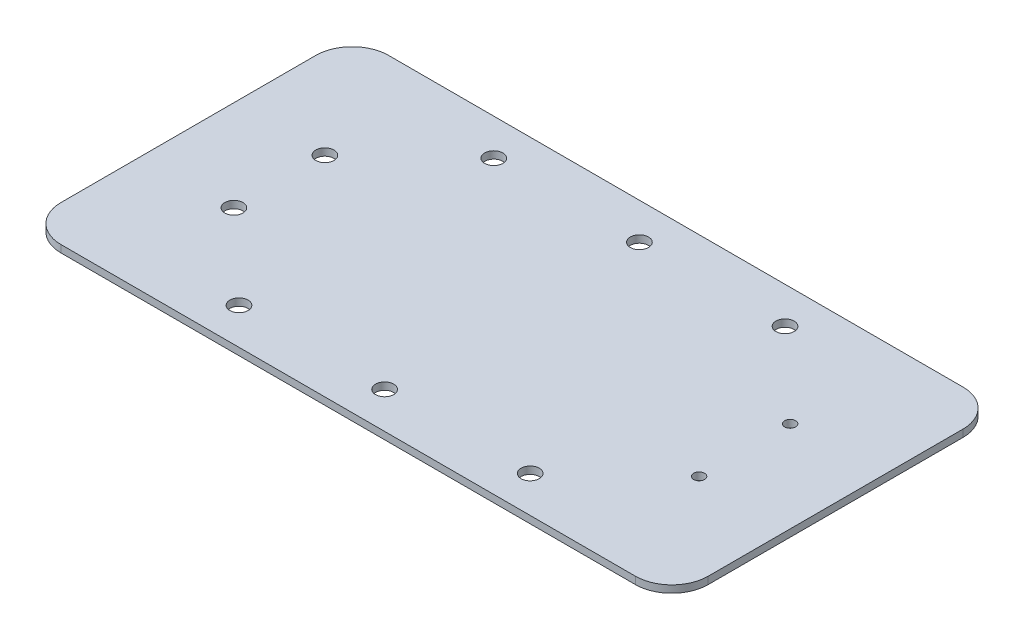
ISO-10303-21;
HEADER;
FILE_DESCRIPTION(('STEP AP214'),'2;1');
FILE_NAME('part.step','',(''),(''),'','','');
FILE_SCHEMA(('AUTOMOTIVE_DESIGN { 1 0 10303 214 1 1 1 1 }'));
ENDSEC;
DATA;
#1=APPLICATION_CONTEXT('core data for automotive mechanical design processes');
#2=APPLICATION_PROTOCOL_DEFINITION('international standard','automotive_design',2000,#1);
#3=PRODUCT_CONTEXT('',#1,'mechanical');
#4=PRODUCT('Part','Part','',(#3));
#5=PRODUCT_RELATED_PRODUCT_CATEGORY('part','',(#4));
#6=PRODUCT_DEFINITION_FORMATION('','',#4);
#7=PRODUCT_DEFINITION_CONTEXT('part definition',#1,'design');
#8=PRODUCT_DEFINITION('design','',#6,#7);
#9=PRODUCT_DEFINITION_SHAPE('','',#8);
#10=(LENGTH_UNIT() NAMED_UNIT(*) SI_UNIT(.MILLI.,.METRE.));
#11=(NAMED_UNIT(*) PLANE_ANGLE_UNIT() SI_UNIT($,.RADIAN.));
#12=(NAMED_UNIT(*) SI_UNIT($,.STERADIAN.) SOLID_ANGLE_UNIT());
#13=UNCERTAINTY_MEASURE_WITH_UNIT(LENGTH_MEASURE(1.E-05),#10,'distance_accuracy_value','');
#14=(GEOMETRIC_REPRESENTATION_CONTEXT(3) GLOBAL_UNCERTAINTY_ASSIGNED_CONTEXT((#13)) GLOBAL_UNIT_ASSIGNED_CONTEXT((#10,
#11,#12)) REPRESENTATION_CONTEXT('',''));
#15=CARTESIAN_POINT('',(0.,0.,0.));
#16=DIRECTION('',(0.,0.,1.));
#17=DIRECTION('',(1.,0.,0.));
#18=AXIS2_PLACEMENT_3D('',#15,#16,#17);
#19=CARTESIAN_POINT('',(0.,2.,0.));
#20=DIRECTION('',(0.,1.,0.));
#21=DIRECTION('',(0.,0.,1.));
#22=AXIS2_PLACEMENT_3D('',#19,#20,#21);
#23=PLANE('',#22);
#24=CARTESIAN_POINT('',(63.9,2.,12.5));
#25=DIRECTION('',(0.,1.,0.));
#26=DIRECTION('',(0.,0.,1.));
#27=AXIS2_PLACEMENT_3D('',#24,#25,#26);
#28=CIRCLE('',#27,1.5);
#29=CARTESIAN_POINT('',(63.9,2.,14.));
#30=VERTEX_POINT('',#29);
#31=EDGE_CURVE('E434',#30,#30,#28,.T.);
#32=ORIENTED_EDGE('',*,*,#31,.F.);
#33=EDGE_LOOP('',(#32));
#34=FACE_BOUND('',#33,.T.);
#35=CARTESIAN_POINT('',(63.9,2.,-12.5));
#36=DIRECTION('',(0.,1.,0.));
#37=DIRECTION('',(0.,0.,1.));
#38=AXIS2_PLACEMENT_3D('',#35,#36,#37);
#39=CIRCLE('',#38,1.5);
#40=CARTESIAN_POINT('',(63.9,2.,-11.));
#41=VERTEX_POINT('',#40);
#42=EDGE_CURVE('E442',#41,#41,#39,.F.);
#43=ORIENTED_EDGE('',*,*,#42,.T.);
#44=EDGE_LOOP('',(#43));
#45=FACE_BOUND('',#44,.T.);
#46=CARTESIAN_POINT('',(-63.9,2.,12.5));
#47=DIRECTION('',(0.,1.,0.));
#48=DIRECTION('',(0.,0.,1.));
#49=AXIS2_PLACEMENT_3D('',#46,#47,#48);
#50=CIRCLE('',#49,2.5);
#51=CARTESIAN_POINT('',(-63.9,2.,15.));
#52=VERTEX_POINT('',#51);
#53=EDGE_CURVE('E242',#52,#52,#50,.F.);
#54=ORIENTED_EDGE('',*,*,#53,.T.);
#55=EDGE_LOOP('',(#54));
#56=FACE_BOUND('',#55,.T.);
#57=CARTESIAN_POINT('',(0.,2.,-35.));
#58=DIRECTION('',(0.,1.,0.));
#59=DIRECTION('',(0.,0.,1.));
#60=AXIS2_PLACEMENT_3D('',#57,#58,#59);
#61=CIRCLE('',#60,2.5);
#62=CARTESIAN_POINT('',(0.,2.,-32.5));
#63=VERTEX_POINT('',#62);
#64=EDGE_CURVE('E170',#63,#63,#61,.T.);
#65=ORIENTED_EDGE('',*,*,#64,.F.);
#66=EDGE_LOOP('',(#65));
#67=FACE_BOUND('',#66,.T.);
#68=CARTESIAN_POINT('',(40.,2.,-35.));
#69=DIRECTION('',(0.,1.,0.));
#70=DIRECTION('',(0.,0.,1.));
#71=AXIS2_PLACEMENT_3D('',#68,#69,#70);
#72=CIRCLE('',#71,2.5);
#73=CARTESIAN_POINT('',(40.,2.,-32.5));
#74=VERTEX_POINT('',#73);
#75=EDGE_CURVE('E232',#74,#74,#72,.T.);
#76=ORIENTED_EDGE('',*,*,#75,.F.);
#77=EDGE_LOOP('',(#76));
#78=FACE_BOUND('',#77,.T.);
#79=CARTESIAN_POINT('',(-40.,2.,-34.9999999999997));
#80=DIRECTION('',(0.,1.,0.));
#81=DIRECTION('',(0.,0.,1.));
#82=AXIS2_PLACEMENT_3D('',#79,#80,#81);
#83=CIRCLE('',#82,2.5);
#84=CARTESIAN_POINT('',(-40.,2.,-32.4999999999997));
#85=VERTEX_POINT('',#84);
#86=EDGE_CURVE('E228',#85,#85,#83,.T.);
#87=ORIENTED_EDGE('',*,*,#86,.F.);
#88=EDGE_LOOP('',(#87));
#89=FACE_BOUND('',#88,.T.);
#90=DIRECTION('',(1.,0.,0.));
#91=VECTOR('',#90,1.);
#92=CARTESIAN_POINT('',(0.,2.,45.));
#93=LINE('',#92,#91);
#94=CARTESIAN_POINT('',(-78.9,2.,45.));
#95=VERTEX_POINT('',#94);
#96=CARTESIAN_POINT('',(78.9,2.,45.));
#97=VERTEX_POINT('',#96);
#98=EDGE_CURVE('E224',#95,#97,#93,.T.);
#99=ORIENTED_EDGE('',*,*,#98,.T.);
#100=CARTESIAN_POINT('',(78.9,2.,35.));
#101=DIRECTION('',(0.,1.,0.));
#102=DIRECTION('',(0.,0.,1.));
#103=AXIS2_PLACEMENT_3D('',#100,#101,#102);
#104=CIRCLE('',#103,10.);
#105=CARTESIAN_POINT('',(88.9,2.,35.));
#106=VERTEX_POINT('',#105);
#107=EDGE_CURVE('E194',#97,#106,#104,.T.);
#108=ORIENTED_EDGE('',*,*,#107,.T.);
#109=DIRECTION('',(0.,0.,-1.));
#110=VECTOR('',#109,1.);
#111=CARTESIAN_POINT('',(88.9,2.,0.));
#112=LINE('',#111,#110);
#113=CARTESIAN_POINT('',(88.9,2.,-35.));
#114=VERTEX_POINT('',#113);
#115=EDGE_CURVE('E135',#106,#114,#112,.T.);
#116=ORIENTED_EDGE('',*,*,#115,.T.);
#117=CARTESIAN_POINT('',(78.9,2.,-35.));
#118=DIRECTION('',(0.,1.,0.));
#119=DIRECTION('',(0.,0.,1.));
#120=AXIS2_PLACEMENT_3D('',#117,#118,#119);
#121=CIRCLE('',#120,10.);
#122=CARTESIAN_POINT('',(78.9,2.,-45.));
#123=VERTEX_POINT('',#122);
#124=EDGE_CURVE('E191',#114,#123,#121,.T.);
#125=ORIENTED_EDGE('',*,*,#124,.T.);
#126=DIRECTION('',(1.,0.,0.));
#127=VECTOR('',#126,1.);
#128=CARTESIAN_POINT('',(0.,2.,-45.));
#129=LINE('',#128,#127);
#130=CARTESIAN_POINT('',(-78.9,2.,-45.));
#131=VERTEX_POINT('',#130);
#132=EDGE_CURVE('E218',#131,#123,#129,.T.);
#133=ORIENTED_EDGE('',*,*,#132,.F.);
#134=CARTESIAN_POINT('',(-78.9,2.,-35.));
#135=DIRECTION('',(0.,1.,0.));
#136=DIRECTION('',(0.,0.,1.));
#137=AXIS2_PLACEMENT_3D('',#134,#135,#136);
#138=CIRCLE('',#137,10.);
#139=CARTESIAN_POINT('',(-88.9,2.,-35.));
#140=VERTEX_POINT('',#139);
#141=EDGE_CURVE('E63',#131,#140,#138,.T.);
#142=ORIENTED_EDGE('',*,*,#141,.T.);
#143=DIRECTION('',(0.,0.,-1.));
#144=VECTOR('',#143,1.);
#145=CARTESIAN_POINT('',(-88.9,2.,0.));
#146=LINE('',#145,#144);
#147=CARTESIAN_POINT('',(-88.9,2.,35.));
#148=VERTEX_POINT('',#147);
#149=EDGE_CURVE('E215',#148,#140,#146,.T.);
#150=ORIENTED_EDGE('',*,*,#149,.F.);
#151=CARTESIAN_POINT('',(-78.9,2.,35.));
#152=DIRECTION('',(0.,1.,0.));
#153=DIRECTION('',(0.,0.,1.));
#154=AXIS2_PLACEMENT_3D('',#151,#152,#153);
#155=CIRCLE('',#154,10.);
#156=EDGE_CURVE('E186',#148,#95,#155,.T.);
#157=ORIENTED_EDGE('',*,*,#156,.T.);
#158=EDGE_LOOP('',(#99,#108,#116,#125,#133,#142,#150,#157));
#159=FACE_BOUND('',#158,.T.);
#160=CARTESIAN_POINT('',(0.,2.,35.));
#161=DIRECTION('',(0.,1.,0.));
#162=DIRECTION('',(0.,0.,1.));
#163=AXIS2_PLACEMENT_3D('',#160,#161,#162);
#164=CIRCLE('',#163,2.5);
#165=CARTESIAN_POINT('',(0.,2.,37.5));
#166=VERTEX_POINT('',#165);
#167=EDGE_CURVE('E211',#166,#166,#164,.F.);
#168=ORIENTED_EDGE('',*,*,#167,.T.);
#169=EDGE_LOOP('',(#168));
#170=FACE_BOUND('',#169,.T.);
#171=CARTESIAN_POINT('',(40.,2.,35.));
#172=DIRECTION('',(0.,1.,0.));
#173=DIRECTION('',(0.,0.,1.));
#174=AXIS2_PLACEMENT_3D('',#171,#172,#173);
#175=CIRCLE('',#174,2.5);
#176=CARTESIAN_POINT('',(40.,2.,37.5));
#177=VERTEX_POINT('',#176);
#178=EDGE_CURVE('E207',#177,#177,#175,.F.);
#179=ORIENTED_EDGE('',*,*,#178,.T.);
#180=EDGE_LOOP('',(#179));
#181=FACE_BOUND('',#180,.T.);
#182=CARTESIAN_POINT('',(-40.,2.,35.0000000000003));
#183=DIRECTION('',(0.,1.,0.));
#184=DIRECTION('',(0.,0.,1.));
#185=AXIS2_PLACEMENT_3D('',#182,#183,#184);
#186=CIRCLE('',#185,2.5);
#187=CARTESIAN_POINT('',(-40.,2.,37.5000000000003));
#188=VERTEX_POINT('',#187);
#189=EDGE_CURVE('E172',#188,#188,#186,.F.);
#190=ORIENTED_EDGE('',*,*,#189,.T.);
#191=EDGE_LOOP('',(#190));
#192=FACE_BOUND('',#191,.T.);
#193=CARTESIAN_POINT('',(-63.9,2.,-12.5));
#194=DIRECTION('',(0.,1.,0.));
#195=DIRECTION('',(0.,0.,1.));
#196=AXIS2_PLACEMENT_3D('',#193,#194,#195);
#197=CIRCLE('',#196,2.5);
#198=CARTESIAN_POINT('',(-63.9,2.,-10.));
#199=VERTEX_POINT('',#198);
#200=EDGE_CURVE('E426',#199,#199,#197,.T.);
#201=ORIENTED_EDGE('',*,*,#200,.F.);
#202=EDGE_LOOP('',(#201));
#203=FACE_BOUND('',#202,.T.);
#204=ADVANCED_FACE('F47',(#34,#45,#56,#67,#78,#89,#159,#170,#181,#192,#203),#23,.T.);
#205=CARTESIAN_POINT('',(0.,0.,0.));
#206=DIRECTION('',(0.,1.,0.));
#207=DIRECTION('',(0.,0.,1.));
#208=AXIS2_PLACEMENT_3D('',#205,#206,#207);
#209=PLANE('',#208);
#210=CARTESIAN_POINT('',(63.9,0.,-12.5));
#211=DIRECTION('',(0.,-1.,0.));
#212=DIRECTION('',(0.,0.,-1.));
#213=AXIS2_PLACEMENT_3D('',#210,#211,#212);
#214=CIRCLE('',#213,1.5);
#215=CARTESIAN_POINT('',(63.9,0.,-14.));
#216=VERTEX_POINT('',#215);
#217=EDGE_CURVE('E449',#216,#216,#214,.T.);
#218=ORIENTED_EDGE('',*,*,#217,.F.);
#219=EDGE_LOOP('',(#218));
#220=FACE_BOUND('',#219,.T.);
#221=CARTESIAN_POINT('',(-63.9,0.,12.5));
#222=DIRECTION('',(0.,-1.,0.));
#223=DIRECTION('',(0.,0.,-1.));
#224=AXIS2_PLACEMENT_3D('',#221,#222,#223);
#225=CIRCLE('',#224,2.5);
#226=CARTESIAN_POINT('',(-63.9,0.,10.));
#227=VERTEX_POINT('',#226);
#228=EDGE_CURVE('E429',#227,#227,#225,.T.);
#229=ORIENTED_EDGE('',*,*,#228,.F.);
#230=EDGE_LOOP('',(#229));
#231=FACE_BOUND('',#230,.T.);
#232=CARTESIAN_POINT('',(0.,0.,-35.));
#233=DIRECTION('',(0.,1.,0.));
#234=DIRECTION('',(0.,0.,1.));
#235=AXIS2_PLACEMENT_3D('',#232,#233,#234);
#236=CIRCLE('',#235,2.5);
#237=CARTESIAN_POINT('',(0.,0.,-32.5));
#238=VERTEX_POINT('',#237);
#239=EDGE_CURVE('E245',#238,#238,#236,.T.);
#240=ORIENTED_EDGE('',*,*,#239,.T.);
#241=EDGE_LOOP('',(#240));
#242=FACE_BOUND('',#241,.T.);
#243=CARTESIAN_POINT('',(40.,0.,-35.));
#244=DIRECTION('',(0.,1.,0.));
#245=DIRECTION('',(0.,0.,1.));
#246=AXIS2_PLACEMENT_3D('',#243,#244,#245);
#247=CIRCLE('',#246,2.5);
#248=CARTESIAN_POINT('',(40.,0.,-32.5));
#249=VERTEX_POINT('',#248);
#250=EDGE_CURVE('E249',#249,#249,#247,.T.);
#251=ORIENTED_EDGE('',*,*,#250,.T.);
#252=EDGE_LOOP('',(#251));
#253=FACE_BOUND('',#252,.T.);
#254=CARTESIAN_POINT('',(-40.,0.,-34.9999999999997));
#255=DIRECTION('',(0.,1.,0.));
#256=DIRECTION('',(0.,0.,1.));
#257=AXIS2_PLACEMENT_3D('',#254,#255,#256);
#258=CIRCLE('',#257,2.5);
#259=CARTESIAN_POINT('',(-40.,0.,-32.4999999999997));
#260=VERTEX_POINT('',#259);
#261=EDGE_CURVE('E151',#260,#260,#258,.T.);
#262=ORIENTED_EDGE('',*,*,#261,.T.);
#263=EDGE_LOOP('',(#262));
#264=FACE_BOUND('',#263,.T.);
#265=DIRECTION('',(0.,0.,-1.));
#266=VECTOR('',#265,1.);
#267=CARTESIAN_POINT('',(88.9,0.,0.));
#268=LINE('',#267,#266);
#269=CARTESIAN_POINT('',(88.9,0.,35.));
#270=VERTEX_POINT('',#269);
#271=CARTESIAN_POINT('',(88.9,0.,-35.));
#272=VERTEX_POINT('',#271);
#273=EDGE_CURVE('E132',#270,#272,#268,.T.);
#274=ORIENTED_EDGE('',*,*,#273,.F.);
#275=CARTESIAN_POINT('',(78.9,0.,35.));
#276=DIRECTION('',(0.,1.,0.));
#277=DIRECTION('',(0.,0.,1.));
#278=AXIS2_PLACEMENT_3D('',#275,#276,#277);
#279=CIRCLE('',#278,10.);
#280=CARTESIAN_POINT('',(78.9,0.,45.));
#281=VERTEX_POINT('',#280);
#282=EDGE_CURVE('E114',#270,#281,#279,.F.);
#283=ORIENTED_EDGE('',*,*,#282,.T.);
#284=DIRECTION('',(1.,0.,0.));
#285=VECTOR('',#284,1.);
#286=CARTESIAN_POINT('',(0.,0.,45.));
#287=LINE('',#286,#285);
#288=CARTESIAN_POINT('',(-78.9,0.,45.));
#289=VERTEX_POINT('',#288);
#290=EDGE_CURVE('E145',#289,#281,#287,.T.);
#291=ORIENTED_EDGE('',*,*,#290,.F.);
#292=CARTESIAN_POINT('',(-78.9,0.,35.));
#293=DIRECTION('',(0.,1.,0.));
#294=DIRECTION('',(0.,0.,1.));
#295=AXIS2_PLACEMENT_3D('',#292,#293,#294);
#296=CIRCLE('',#295,10.);
#297=CARTESIAN_POINT('',(-88.9,0.,35.));
#298=VERTEX_POINT('',#297);
#299=EDGE_CURVE('E137',#289,#298,#296,.F.);
#300=ORIENTED_EDGE('',*,*,#299,.T.);
#301=DIRECTION('',(0.,0.,-1.));
#302=VECTOR('',#301,1.);
#303=CARTESIAN_POINT('',(-88.9,0.,0.));
#304=LINE('',#303,#302);
#305=CARTESIAN_POINT('',(-88.9,0.,-35.));
#306=VERTEX_POINT('',#305);
#307=EDGE_CURVE('E149',#298,#306,#304,.T.);
#308=ORIENTED_EDGE('',*,*,#307,.T.);
#309=CARTESIAN_POINT('',(-78.9,0.,-35.));
#310=DIRECTION('',(0.,1.,0.));
#311=DIRECTION('',(0.,0.,1.));
#312=AXIS2_PLACEMENT_3D('',#309,#310,#311);
#313=CIRCLE('',#312,10.);
#314=CARTESIAN_POINT('',(-78.9,0.,-45.));
#315=VERTEX_POINT('',#314);
#316=EDGE_CURVE('E176',#306,#315,#313,.F.);
#317=ORIENTED_EDGE('',*,*,#316,.T.);
#318=DIRECTION('',(1.,0.,0.));
#319=VECTOR('',#318,1.);
#320=CARTESIAN_POINT('',(0.,0.,-45.));
#321=LINE('',#320,#319);
#322=CARTESIAN_POINT('',(78.9,0.,-45.));
#323=VERTEX_POINT('',#322);
#324=EDGE_CURVE('E144',#315,#323,#321,.T.);
#325=ORIENTED_EDGE('',*,*,#324,.T.);
#326=CARTESIAN_POINT('',(78.9,0.,-35.));
#327=DIRECTION('',(0.,1.,0.));
#328=DIRECTION('',(0.,0.,1.));
#329=AXIS2_PLACEMENT_3D('',#326,#327,#328);
#330=CIRCLE('',#329,10.);
#331=EDGE_CURVE('E126',#323,#272,#330,.F.);
#332=ORIENTED_EDGE('',*,*,#331,.T.);
#333=EDGE_LOOP('',(#274,#283,#291,#300,#308,#317,#325,#332));
#334=FACE_BOUND('',#333,.T.);
#335=CARTESIAN_POINT('',(0.,0.,35.));
#336=DIRECTION('',(0.,1.,0.));
#337=DIRECTION('',(0.,0.,1.));
#338=AXIS2_PLACEMENT_3D('',#335,#336,#337);
#339=CIRCLE('',#338,2.5);
#340=CARTESIAN_POINT('',(0.,0.,37.5));
#341=VERTEX_POINT('',#340);
#342=EDGE_CURVE('E158',#341,#341,#339,.F.);
#343=ORIENTED_EDGE('',*,*,#342,.F.);
#344=EDGE_LOOP('',(#343));
#345=FACE_BOUND('',#344,.T.);
#346=CARTESIAN_POINT('',(40.,0.,35.));
#347=DIRECTION('',(0.,1.,0.));
#348=DIRECTION('',(0.,0.,1.));
#349=AXIS2_PLACEMENT_3D('',#346,#347,#348);
#350=CIRCLE('',#349,2.5);
#351=CARTESIAN_POINT('',(40.,0.,37.5));
#352=VERTEX_POINT('',#351);
#353=EDGE_CURVE('E162',#352,#352,#350,.F.);
#354=ORIENTED_EDGE('',*,*,#353,.F.);
#355=EDGE_LOOP('',(#354));
#356=FACE_BOUND('',#355,.T.);
#357=CARTESIAN_POINT('',(-40.,0.,35.0000000000003));
#358=DIRECTION('',(0.,1.,0.));
#359=DIRECTION('',(0.,0.,1.));
#360=AXIS2_PLACEMENT_3D('',#357,#358,#359);
#361=CIRCLE('',#360,2.5);
#362=CARTESIAN_POINT('',(-40.,0.,37.5000000000003));
#363=VERTEX_POINT('',#362);
#364=EDGE_CURVE('E166',#363,#363,#361,.F.);
#365=ORIENTED_EDGE('',*,*,#364,.F.);
#366=EDGE_LOOP('',(#365));
#367=FACE_BOUND('',#366,.T.);
#368=CARTESIAN_POINT('',(63.9,0.,12.5));
#369=DIRECTION('',(0.,-1.,0.));
#370=DIRECTION('',(0.,0.,-1.));
#371=AXIS2_PLACEMENT_3D('',#368,#369,#370);
#372=CIRCLE('',#371,1.5);
#373=CARTESIAN_POINT('',(63.9,0.,11.));
#374=VERTEX_POINT('',#373);
#375=EDGE_CURVE('E438',#374,#374,#372,.F.);
#376=ORIENTED_EDGE('',*,*,#375,.T.);
#377=EDGE_LOOP('',(#376));
#378=FACE_BOUND('',#377,.T.);
#379=CARTESIAN_POINT('',(-63.9,0.,-12.5));
#380=DIRECTION('',(0.,-1.,0.));
#381=DIRECTION('',(0.,0.,-1.));
#382=AXIS2_PLACEMENT_3D('',#379,#380,#381);
#383=CIRCLE('',#382,2.5);
#384=CARTESIAN_POINT('',(-63.9,0.,-15.));
#385=VERTEX_POINT('',#384);
#386=EDGE_CURVE('E423',#385,#385,#383,.F.);
#387=ORIENTED_EDGE('',*,*,#386,.T.);
#388=EDGE_LOOP('',(#387));
#389=FACE_BOUND('',#388,.T.);
#390=ADVANCED_FACE('F140',(#220,#231,#242,#253,#264,#334,#345,#356,#367,#378,#389),#209,.F.);
#391=CARTESIAN_POINT('',(0.,2.,45.));
#392=DIRECTION('',(0.,0.,-1.));
#393=DIRECTION('',(-1.,0.,0.));
#394=AXIS2_PLACEMENT_3D('',#391,#392,#393);
#395=PLANE('',#394);
#396=ORIENTED_EDGE('',*,*,#290,.T.);
#397=DIRECTION('',(0.,-1.,0.));
#398=VECTOR('',#397,1.);
#399=CARTESIAN_POINT('',(78.9,2.,45.));
#400=LINE('',#399,#398);
#401=EDGE_CURVE('E119',#281,#97,#400,.F.);
#402=ORIENTED_EDGE('',*,*,#401,.T.);
#403=ORIENTED_EDGE('',*,*,#98,.F.);
#404=DIRECTION('',(0.,-1.,0.));
#405=VECTOR('',#404,1.);
#406=CARTESIAN_POINT('',(-78.9,0.,45.));
#407=LINE('',#406,#405);
#408=EDGE_CURVE('E125',#95,#289,#407,.T.);
#409=ORIENTED_EDGE('',*,*,#408,.T.);
#410=EDGE_LOOP('',(#396,#402,#403,#409));
#411=FACE_BOUND('',#410,.T.);
#412=ADVANCED_FACE('F281',(#411),#395,.F.);
#413=CARTESIAN_POINT('',(88.9,2.,0.));
#414=DIRECTION('',(-1.,0.,0.));
#415=DIRECTION('',(0.,0.,1.));
#416=AXIS2_PLACEMENT_3D('',#413,#414,#415);
#417=PLANE('',#416);
#418=ORIENTED_EDGE('',*,*,#115,.F.);
#419=DIRECTION('',(0.,-1.,0.));
#420=VECTOR('',#419,1.);
#421=CARTESIAN_POINT('',(88.9,2.,35.));
#422=LINE('',#421,#420);
#423=EDGE_CURVE('E118',#106,#270,#422,.T.);
#424=ORIENTED_EDGE('',*,*,#423,.T.);
#425=ORIENTED_EDGE('',*,*,#273,.T.);
#426=DIRECTION('',(0.,-1.,0.));
#427=VECTOR('',#426,1.);
#428=CARTESIAN_POINT('',(88.9,2.,-35.));
#429=LINE('',#428,#427);
#430=EDGE_CURVE('E138',#272,#114,#429,.F.);
#431=ORIENTED_EDGE('',*,*,#430,.T.);
#432=EDGE_LOOP('',(#418,#424,#425,#431));
#433=FACE_BOUND('',#432,.T.);
#434=ADVANCED_FACE('F131',(#433),#417,.F.);
#435=CARTESIAN_POINT('',(0.,2.,-45.));
#436=DIRECTION('',(0.,0.,-1.));
#437=DIRECTION('',(-1.,0.,0.));
#438=AXIS2_PLACEMENT_3D('',#435,#436,#437);
#439=PLANE('',#438);
#440=ORIENTED_EDGE('',*,*,#132,.T.);
#441=DIRECTION('',(0.,-1.,0.));
#442=VECTOR('',#441,1.);
#443=CARTESIAN_POINT('',(78.9,0.,-45.));
#444=LINE('',#443,#442);
#445=EDGE_CURVE('E200',#123,#323,#444,.T.);
#446=ORIENTED_EDGE('',*,*,#445,.T.);
#447=ORIENTED_EDGE('',*,*,#324,.F.);
#448=DIRECTION('',(0.,-1.,0.));
#449=VECTOR('',#448,1.);
#450=CARTESIAN_POINT('',(-78.9,2.,-45.));
#451=LINE('',#450,#449);
#452=EDGE_CURVE('E197',#315,#131,#451,.F.);
#453=ORIENTED_EDGE('',*,*,#452,.T.);
#454=EDGE_LOOP('',(#440,#446,#447,#453));
#455=FACE_BOUND('',#454,.T.);
#456=ADVANCED_FACE('F297',(#455),#439,.T.);
#457=CARTESIAN_POINT('',(40.,2.,35.));
#458=DIRECTION('',(0.,-1.,0.));
#459=DIRECTION('',(0.,0.,-1.));
#460=AXIS2_PLACEMENT_3D('',#457,#458,#459);
#461=CYLINDRICAL_SURFACE('',#460,2.5);
#462=ORIENTED_EDGE('',*,*,#178,.F.);
#463=EDGE_LOOP('',(#462));
#464=FACE_BOUND('',#463,.T.);
#465=ORIENTED_EDGE('',*,*,#353,.T.);
#466=EDGE_LOOP('',(#465));
#467=FACE_BOUND('',#466,.T.);
#468=ADVANCED_FACE('F294',(#464,#467),#461,.F.);
#469=CARTESIAN_POINT('',(0.,2.,35.));
#470=DIRECTION('',(0.,-1.,0.));
#471=DIRECTION('',(0.,0.,-1.));
#472=AXIS2_PLACEMENT_3D('',#469,#470,#471);
#473=CYLINDRICAL_SURFACE('',#472,2.5);
#474=ORIENTED_EDGE('',*,*,#167,.F.);
#475=EDGE_LOOP('',(#474));
#476=FACE_BOUND('',#475,.T.);
#477=ORIENTED_EDGE('',*,*,#342,.T.);
#478=EDGE_LOOP('',(#477));
#479=FACE_BOUND('',#478,.T.);
#480=ADVANCED_FACE('F271',(#476,#479),#473,.F.);
#481=CARTESIAN_POINT('',(-88.9,2.,0.));
#482=DIRECTION('',(-1.,0.,0.));
#483=DIRECTION('',(0.,0.,1.));
#484=AXIS2_PLACEMENT_3D('',#481,#482,#483);
#485=PLANE('',#484);
#486=ORIENTED_EDGE('',*,*,#149,.T.);
#487=DIRECTION('',(0.,-1.,0.));
#488=VECTOR('',#487,1.);
#489=CARTESIAN_POINT('',(-88.9,2.,-35.));
#490=LINE('',#489,#488);
#491=EDGE_CURVE('E11',#140,#306,#490,.T.);
#492=ORIENTED_EDGE('',*,*,#491,.T.);
#493=ORIENTED_EDGE('',*,*,#307,.F.);
#494=DIRECTION('',(0.,-1.,0.));
#495=VECTOR('',#494,1.);
#496=CARTESIAN_POINT('',(-88.9,2.,35.));
#497=LINE('',#496,#495);
#498=EDGE_CURVE('E56',#298,#148,#497,.F.);
#499=ORIENTED_EDGE('',*,*,#498,.T.);
#500=EDGE_LOOP('',(#486,#492,#493,#499));
#501=FACE_BOUND('',#500,.T.);
#502=ADVANCED_FACE('F260',(#501),#485,.T.);
#503=CARTESIAN_POINT('',(-40.,2.,-34.9999999999997));
#504=DIRECTION('',(0.,-1.,0.));
#505=DIRECTION('',(0.,0.,-1.));
#506=AXIS2_PLACEMENT_3D('',#503,#504,#505);
#507=CYLINDRICAL_SURFACE('',#506,2.5);
#508=ORIENTED_EDGE('',*,*,#86,.T.);
#509=EDGE_LOOP('',(#508));
#510=FACE_BOUND('',#509,.T.);
#511=ORIENTED_EDGE('',*,*,#261,.F.);
#512=EDGE_LOOP('',(#511));
#513=FACE_BOUND('',#512,.T.);
#514=ADVANCED_FACE('F257',(#510,#513),#507,.F.);
#515=CARTESIAN_POINT('',(40.,2.,-35.));
#516=DIRECTION('',(0.,-1.,0.));
#517=DIRECTION('',(0.,0.,-1.));
#518=AXIS2_PLACEMENT_3D('',#515,#516,#517);
#519=CYLINDRICAL_SURFACE('',#518,2.5);
#520=ORIENTED_EDGE('',*,*,#75,.T.);
#521=EDGE_LOOP('',(#520));
#522=FACE_BOUND('',#521,.T.);
#523=ORIENTED_EDGE('',*,*,#250,.F.);
#524=EDGE_LOOP('',(#523));
#525=FACE_BOUND('',#524,.T.);
#526=ADVANCED_FACE('F259',(#522,#525),#519,.F.);
#527=CARTESIAN_POINT('',(0.,2.,-35.));
#528=DIRECTION('',(0.,-1.,0.));
#529=DIRECTION('',(0.,0.,-1.));
#530=AXIS2_PLACEMENT_3D('',#527,#528,#529);
#531=CYLINDRICAL_SURFACE('',#530,2.5);
#532=ORIENTED_EDGE('',*,*,#64,.T.);
#533=EDGE_LOOP('',(#532));
#534=FACE_BOUND('',#533,.T.);
#535=ORIENTED_EDGE('',*,*,#239,.F.);
#536=EDGE_LOOP('',(#535));
#537=FACE_BOUND('',#536,.T.);
#538=ADVANCED_FACE('F267',(#534,#537),#531,.F.);
#539=CARTESIAN_POINT('',(-40.,2.,35.0000000000003));
#540=DIRECTION('',(0.,-1.,0.));
#541=DIRECTION('',(0.,0.,-1.));
#542=AXIS2_PLACEMENT_3D('',#539,#540,#541);
#543=CYLINDRICAL_SURFACE('',#542,2.5);
#544=ORIENTED_EDGE('',*,*,#189,.F.);
#545=EDGE_LOOP('',(#544));
#546=FACE_BOUND('',#545,.T.);
#547=ORIENTED_EDGE('',*,*,#364,.T.);
#548=EDGE_LOOP('',(#547));
#549=FACE_BOUND('',#548,.T.);
#550=ADVANCED_FACE('F290',(#546,#549),#543,.F.);
#551=CARTESIAN_POINT('',(78.9,2.,35.));
#552=DIRECTION('',(0.,-1.,0.));
#553=DIRECTION('',(0.,0.,-1.));
#554=AXIS2_PLACEMENT_3D('',#551,#552,#553);
#555=CYLINDRICAL_SURFACE('',#554,10.);
#556=ORIENTED_EDGE('',*,*,#107,.F.);
#557=ORIENTED_EDGE('',*,*,#401,.F.);
#558=ORIENTED_EDGE('',*,*,#282,.F.);
#559=ORIENTED_EDGE('',*,*,#423,.F.);
#560=EDGE_LOOP('',(#556,#557,#558,#559));
#561=FACE_BOUND('',#560,.T.);
#562=ADVANCED_FACE('F117',(#561),#555,.T.);
#563=CARTESIAN_POINT('',(78.9,2.,-35.));
#564=DIRECTION('',(0.,1.,0.));
#565=DIRECTION('',(0.,0.,1.));
#566=AXIS2_PLACEMENT_3D('',#563,#564,#565);
#567=CYLINDRICAL_SURFACE('',#566,10.);
#568=ORIENTED_EDGE('',*,*,#124,.F.);
#569=ORIENTED_EDGE('',*,*,#430,.F.);
#570=ORIENTED_EDGE('',*,*,#331,.F.);
#571=ORIENTED_EDGE('',*,*,#445,.F.);
#572=EDGE_LOOP('',(#568,#569,#570,#571));
#573=FACE_BOUND('',#572,.T.);
#574=ADVANCED_FACE('F322',(#573),#567,.T.);
#575=CARTESIAN_POINT('',(-78.9,2.,-35.));
#576=DIRECTION('',(0.,-1.,0.));
#577=DIRECTION('',(0.,0.,-1.));
#578=AXIS2_PLACEMENT_3D('',#575,#576,#577);
#579=CYLINDRICAL_SURFACE('',#578,10.);
#580=ORIENTED_EDGE('',*,*,#141,.F.);
#581=ORIENTED_EDGE('',*,*,#452,.F.);
#582=ORIENTED_EDGE('',*,*,#316,.F.);
#583=ORIENTED_EDGE('',*,*,#491,.F.);
#584=EDGE_LOOP('',(#580,#581,#582,#583));
#585=FACE_BOUND('',#584,.T.);
#586=ADVANCED_FACE('F316',(#585),#579,.T.);
#587=CARTESIAN_POINT('',(-78.9,2.,35.));
#588=DIRECTION('',(0.,1.,0.));
#589=DIRECTION('',(0.,0.,1.));
#590=AXIS2_PLACEMENT_3D('',#587,#588,#589);
#591=CYLINDRICAL_SURFACE('',#590,10.);
#592=ORIENTED_EDGE('',*,*,#156,.F.);
#593=ORIENTED_EDGE('',*,*,#498,.F.);
#594=ORIENTED_EDGE('',*,*,#299,.F.);
#595=ORIENTED_EDGE('',*,*,#408,.F.);
#596=EDGE_LOOP('',(#592,#593,#594,#595));
#597=FACE_BOUND('',#596,.T.);
#598=ADVANCED_FACE('F49',(#597),#591,.T.);
#599=CARTESIAN_POINT('',(-63.9,9.07106781186548,12.5));
#600=DIRECTION('',(0.,-1.,0.));
#601=DIRECTION('',(0.,0.,-1.));
#602=AXIS2_PLACEMENT_3D('',#599,#600,#601);
#603=CYLINDRICAL_SURFACE('',#602,2.5);
#604=ORIENTED_EDGE('',*,*,#228,.T.);
#605=EDGE_LOOP('',(#604));
#606=FACE_BOUND('',#605,.T.);
#607=ORIENTED_EDGE('',*,*,#53,.F.);
#608=EDGE_LOOP('',(#607));
#609=FACE_BOUND('',#608,.T.);
#610=ADVANCED_FACE('F287',(#606,#609),#603,.F.);
#611=CARTESIAN_POINT('',(63.9,9.07106781186548,-12.5));
#612=DIRECTION('',(0.,-1.,0.));
#613=DIRECTION('',(0.,0.,-1.));
#614=AXIS2_PLACEMENT_3D('',#611,#612,#613);
#615=CYLINDRICAL_SURFACE('',#614,1.5);
#616=ORIENTED_EDGE('',*,*,#217,.T.);
#617=EDGE_LOOP('',(#616));
#618=FACE_BOUND('',#617,.T.);
#619=ORIENTED_EDGE('',*,*,#42,.F.);
#620=EDGE_LOOP('',(#619));
#621=FACE_BOUND('',#620,.T.);
#622=ADVANCED_FACE('F389',(#618,#621),#615,.F.);
#623=CARTESIAN_POINT('',(63.9,9.07106781186548,12.5));
#624=DIRECTION('',(0.,-1.,0.));
#625=DIRECTION('',(0.,0.,-1.));
#626=AXIS2_PLACEMENT_3D('',#623,#624,#625);
#627=CYLINDRICAL_SURFACE('',#626,1.5);
#628=ORIENTED_EDGE('',*,*,#375,.F.);
#629=EDGE_LOOP('',(#628));
#630=FACE_BOUND('',#629,.T.);
#631=ORIENTED_EDGE('',*,*,#31,.T.);
#632=EDGE_LOOP('',(#631));
#633=FACE_BOUND('',#632,.T.);
#634=ADVANCED_FACE('F398',(#630,#633),#627,.F.);
#635=CARTESIAN_POINT('',(-63.9,9.07106781186548,-12.5));
#636=DIRECTION('',(0.,-1.,0.));
#637=DIRECTION('',(0.,0.,-1.));
#638=AXIS2_PLACEMENT_3D('',#635,#636,#637);
#639=CYLINDRICAL_SURFACE('',#638,2.5);
#640=ORIENTED_EDGE('',*,*,#386,.F.);
#641=EDGE_LOOP('',(#640));
#642=FACE_BOUND('',#641,.T.);
#643=ORIENTED_EDGE('',*,*,#200,.T.);
#644=EDGE_LOOP('',(#643));
#645=FACE_BOUND('',#644,.T.);
#646=ADVANCED_FACE('F408',(#642,#645),#639,.F.);
#647=CLOSED_SHELL('',(#204,#390,#412,#434,#456,#468,#480,#502,#514,#526,#538,#550,#562,#574,
#586,#598,#610,#622,#634,#646));
#648=MANIFOLD_SOLID_BREP('B2',#647);
#649=ADVANCED_BREP_SHAPE_REPRESENTATION('',(#18,#648),#14);
#650=SHAPE_DEFINITION_REPRESENTATION(#9,#649);
ENDSEC;
END-ISO-10303-21;
